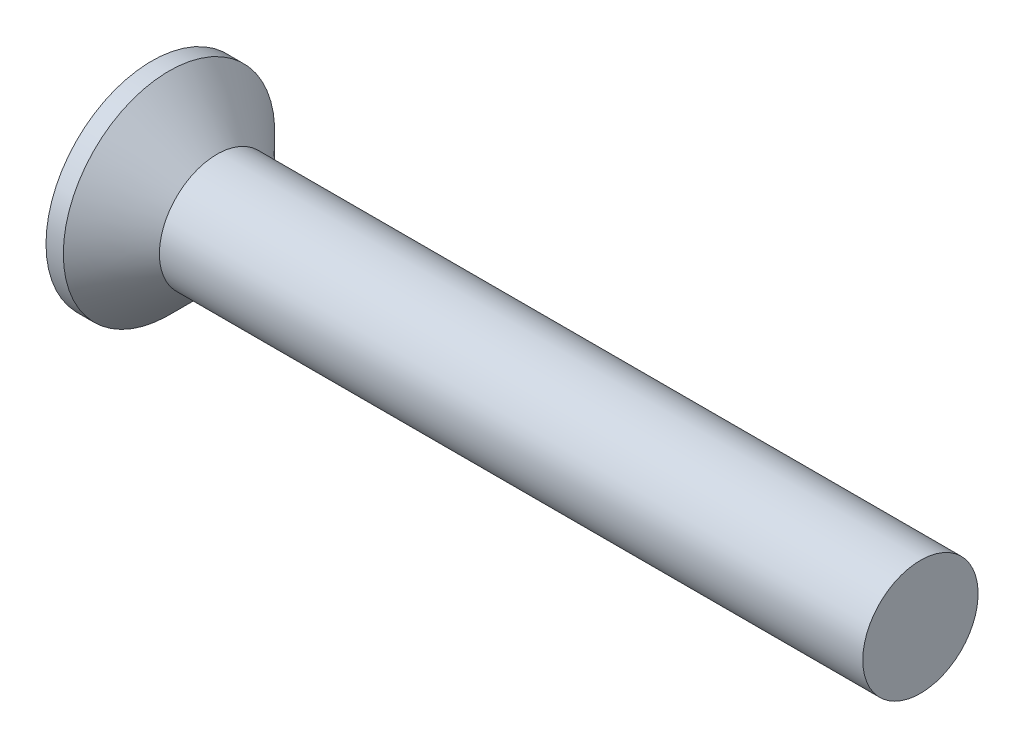
ISO-10303-21;
HEADER;
FILE_DESCRIPTION(('STEP AP214'),'2;1');
FILE_NAME('part.step','',(''),(''),'','','');
FILE_SCHEMA(('AUTOMOTIVE_DESIGN { 1 0 10303 214 1 1 1 1 }'));
ENDSEC;
DATA;
#1=APPLICATION_CONTEXT('core data for automotive mechanical design processes');
#2=APPLICATION_PROTOCOL_DEFINITION('international standard','automotive_design',2000,#1);
#3=PRODUCT_CONTEXT('',#1,'mechanical');
#4=PRODUCT('Part','Part','',(#3));
#5=PRODUCT_RELATED_PRODUCT_CATEGORY('part','',(#4));
#6=PRODUCT_DEFINITION_FORMATION('','',#4);
#7=PRODUCT_DEFINITION_CONTEXT('part definition',#1,'design');
#8=PRODUCT_DEFINITION('design','',#6,#7);
#9=PRODUCT_DEFINITION_SHAPE('','',#8);
#10=(LENGTH_UNIT() NAMED_UNIT(*) SI_UNIT(.MILLI.,.METRE.));
#11=(NAMED_UNIT(*) PLANE_ANGLE_UNIT() SI_UNIT($,.RADIAN.));
#12=(NAMED_UNIT(*) SI_UNIT($,.STERADIAN.) SOLID_ANGLE_UNIT());
#13=UNCERTAINTY_MEASURE_WITH_UNIT(LENGTH_MEASURE(1.E-05),#10,'distance_accuracy_value','');
#14=(GEOMETRIC_REPRESENTATION_CONTEXT(3) GLOBAL_UNCERTAINTY_ASSIGNED_CONTEXT((#13)) GLOBAL_UNIT_ASSIGNED_CONTEXT((#10,
#11,#12)) REPRESENTATION_CONTEXT('',''));
#15=CARTESIAN_POINT('',(0.,0.,0.));
#16=DIRECTION('',(0.,0.,1.));
#17=DIRECTION('',(1.,0.,0.));
#18=AXIS2_PLACEMENT_3D('',#15,#16,#17);
#19=CARTESIAN_POINT('',(0.,0.,0.));
#20=DIRECTION('',(-1.,0.,0.));
#21=DIRECTION('',(0.,0.,1.));
#22=AXIS2_PLACEMENT_3D('',#19,#20,#21);
#23=PLANE('',#22);
#24=CARTESIAN_POINT('',(0.,0.,0.));
#25=DIRECTION('',(-1.,0.,0.));
#26=DIRECTION('',(0.,0.,1.));
#27=AXIS2_PLACEMENT_3D('',#24,#25,#26);
#28=CIRCLE('',#27,2.75);
#29=CARTESIAN_POINT('',(0.,0.,2.75));
#30=VERTEX_POINT('',#29);
#31=EDGE_CURVE('E44',#30,#30,#28,.T.);
#32=ORIENTED_EDGE('',*,*,#31,.T.);
#33=EDGE_LOOP('',(#32));
#34=FACE_BOUND('',#33,.T.);
#35=DIRECTION('',(0.,1.,0.));
#36=VECTOR('',#35,1.);
#37=CARTESIAN_POINT('',(0.,-1.55,-0.395));
#38=LINE('',#37,#36);
#39=CARTESIAN_POINT('',(0.,-1.55,-0.395));
#40=VERTEX_POINT('',#39);
#41=CARTESIAN_POINT('',(0.,-0.394999999999999,-0.395));
#42=VERTEX_POINT('',#41);
#43=EDGE_CURVE('E105',#40,#42,#38,.T.);
#44=ORIENTED_EDGE('',*,*,#43,.T.);
#45=DIRECTION('',(0.,0.,-1.));
#46=VECTOR('',#45,1.);
#47=CARTESIAN_POINT('',(0.,-0.395000000000005,1.55));
#48=LINE('',#47,#46);
#49=CARTESIAN_POINT('',(0.,-0.394999999999995,-1.55));
#50=VERTEX_POINT('',#49);
#51=EDGE_CURVE('E85',#42,#50,#48,.T.);
#52=ORIENTED_EDGE('',*,*,#51,.T.);
#53=DIRECTION('',(0.,1.,0.));
#54=VECTOR('',#53,1.);
#55=CARTESIAN_POINT('',(0.,-0.394999999999995,-1.55));
#56=LINE('',#55,#54);
#57=CARTESIAN_POINT('',(0.,0.395000000000005,-1.55));
#58=VERTEX_POINT('',#57);
#59=EDGE_CURVE('E344',#50,#58,#56,.T.);
#60=ORIENTED_EDGE('',*,*,#59,.T.);
#61=DIRECTION('',(0.,0.,1.));
#62=VECTOR('',#61,1.);
#63=CARTESIAN_POINT('',(0.,0.395000000000005,-1.55));
#64=LINE('',#63,#62);
#65=CARTESIAN_POINT('',(0.,0.395000000000001,-0.395));
#66=VERTEX_POINT('',#65);
#67=EDGE_CURVE('E101',#58,#66,#64,.T.);
#68=ORIENTED_EDGE('',*,*,#67,.T.);
#69=CARTESIAN_POINT('',(0.,1.55,-0.395));
#70=VERTEX_POINT('',#69);
#71=EDGE_CURVE('E95',#66,#70,#38,.T.);
#72=ORIENTED_EDGE('',*,*,#71,.T.);
#73=DIRECTION('',(0.,0.,1.));
#74=VECTOR('',#73,1.);
#75=CARTESIAN_POINT('',(0.,1.55,-0.395));
#76=LINE('',#75,#74);
#77=CARTESIAN_POINT('',(0.,1.55,0.395));
#78=VERTEX_POINT('',#77);
#79=EDGE_CURVE('E98',#70,#78,#76,.T.);
#80=ORIENTED_EDGE('',*,*,#79,.T.);
#81=DIRECTION('',(0.,-1.,0.));
#82=VECTOR('',#81,1.);
#83=CARTESIAN_POINT('',(0.,1.55,0.395));
#84=LINE('',#83,#82);
#85=CARTESIAN_POINT('',(0.,0.394999999999998,0.395));
#86=VERTEX_POINT('',#85);
#87=EDGE_CURVE('E356',#78,#86,#84,.T.);
#88=ORIENTED_EDGE('',*,*,#87,.T.);
#89=CARTESIAN_POINT('',(0.,0.394999999999994,1.55));
#90=VERTEX_POINT('',#89);
#91=EDGE_CURVE('E339',#86,#90,#64,.T.);
#92=ORIENTED_EDGE('',*,*,#91,.T.);
#93=DIRECTION('',(0.,-1.,0.));
#94=VECTOR('',#93,1.);
#95=CARTESIAN_POINT('',(0.,0.394999999999994,1.55));
#96=LINE('',#95,#94);
#97=CARTESIAN_POINT('',(0.,-0.395000000000005,1.55));
#98=VERTEX_POINT('',#97);
#99=EDGE_CURVE('E325',#90,#98,#96,.T.);
#100=ORIENTED_EDGE('',*,*,#99,.T.);
#101=CARTESIAN_POINT('',(0.,-0.395000000000001,0.395));
#102=VERTEX_POINT('',#101);
#103=EDGE_CURVE('E337',#98,#102,#48,.T.);
#104=ORIENTED_EDGE('',*,*,#103,.T.);
#105=CARTESIAN_POINT('',(0.,-1.55,0.395));
#106=VERTEX_POINT('',#105);
#107=EDGE_CURVE('E111',#102,#106,#84,.T.);
#108=ORIENTED_EDGE('',*,*,#107,.T.);
#109=DIRECTION('',(0.,0.,-1.));
#110=VECTOR('',#109,1.);
#111=CARTESIAN_POINT('',(0.,-1.55,0.395));
#112=LINE('',#111,#110);
#113=EDGE_CURVE('E134',#106,#40,#112,.T.);
#114=ORIENTED_EDGE('',*,*,#113,.T.);
#115=EDGE_LOOP('',(#44,#52,#60,#68,#72,#80,#88,#92,#100,#104,#108,#114));
#116=FACE_BOUND('',#115,.T.);
#117=ADVANCED_FACE('F37',(#34,#116),#23,.T.);
#118=CARTESIAN_POINT('',(2.38373382624769,0.,0.16865988909427));
#119=DIRECTION('',(-0.0945267588569115,0.,-0.995522321125954));
#120=DIRECTION('',(-0.995522321125954,0.,0.0945267588569115));
#121=AXIS2_PLACEMENT_3D('',#118,#119,#120);
#122=PLANE('',#121);
#123=ORIENTED_EDGE('',*,*,#107,.F.);
#124=DIRECTION('',(0.991104257398676,0.0941072552097304,-0.0941072552097301));
#125=VECTOR('',#124,1.);
#126=CARTESIAN_POINT('',(2.39946475118715,-0.16716620751949,0.167166207519489));
#127=LINE('',#126,#125);
#128=CARTESIAN_POINT('',(2.08,-0.197500000000001,0.197499999999999));
#129=VERTEX_POINT('',#128);
#130=EDGE_CURVE('E129',#102,#129,#127,.T.);
#131=ORIENTED_EDGE('',*,*,#130,.T.);
#132=DIRECTION('',(0.835707904588477,0.543411029305728,-0.0793520726712617));
#133=VECTOR('',#132,1.);
#134=CARTESIAN_POINT('',(0.,-1.55,0.395));
#135=LINE('',#134,#133);
#136=EDGE_CURVE('E106',#106,#129,#135,.T.);
#137=ORIENTED_EDGE('',*,*,#136,.F.);
#138=EDGE_LOOP('',(#123,#131,#137));
#139=FACE_BOUND('',#138,.T.);
#140=ADVANCED_FACE('F157',(#139),#122,.T.);
#141=DIRECTION('',(0.835707904588477,-0.543411029305729,-0.0793520726712616));
#142=VECTOR('',#141,1.);
#143=CARTESIAN_POINT('',(0.,1.55,0.395));
#144=LINE('',#143,#142);
#145=CARTESIAN_POINT('',(2.08,0.1975,0.1975));
#146=VERTEX_POINT('',#145);
#147=EDGE_CURVE('E51',#78,#146,#144,.T.);
#148=ORIENTED_EDGE('',*,*,#147,.T.);
#149=DIRECTION('',(-0.991104257398676,0.0941072552097297,0.09410725520973));
#150=VECTOR('',#149,1.);
#151=CARTESIAN_POINT('',(2.39946475118715,0.167166207519489,0.167166207519489));
#152=LINE('',#151,#150);
#153=EDGE_CURVE('E352',#146,#86,#152,.T.);
#154=ORIENTED_EDGE('',*,*,#153,.T.);
#155=ORIENTED_EDGE('',*,*,#87,.F.);
#156=EDGE_LOOP('',(#148,#154,#155));
#157=FACE_BOUND('',#156,.T.);
#158=ADVANCED_FACE('F161',(#157),#122,.T.);
#159=CARTESIAN_POINT('',(2.38373382624769,0.,-0.16865988909427));
#160=DIRECTION('',(-0.0945267588569114,0.,0.995522321125954));
#161=DIRECTION('',(0.995522321125954,0.,0.0945267588569114));
#162=AXIS2_PLACEMENT_3D('',#159,#160,#161);
#163=PLANE('',#162);
#164=DIRECTION('',(0.835707904588477,0.543411029305729,0.0793520726712616));
#165=VECTOR('',#164,1.);
#166=CARTESIAN_POINT('',(0.,-1.55,-0.395));
#167=LINE('',#166,#165);
#168=CARTESIAN_POINT('',(2.08,-0.197499999999999,-0.197500000000001));
#169=VERTEX_POINT('',#168);
#170=EDGE_CURVE('E60',#40,#169,#167,.T.);
#171=ORIENTED_EDGE('',*,*,#170,.T.);
#172=DIRECTION('',(-0.991104257398676,-0.0941072552097297,-0.09410725520973));
#173=VECTOR('',#172,1.);
#174=CARTESIAN_POINT('',(2.39946475118715,-0.167166207519489,-0.167166207519489));
#175=LINE('',#174,#173);
#176=EDGE_CURVE('E11',#169,#42,#175,.T.);
#177=ORIENTED_EDGE('',*,*,#176,.T.);
#178=ORIENTED_EDGE('',*,*,#43,.F.);
#179=EDGE_LOOP('',(#171,#177,#178));
#180=FACE_BOUND('',#179,.T.);
#181=ADVANCED_FACE('F154',(#180),#163,.T.);
#182=ORIENTED_EDGE('',*,*,#71,.F.);
#183=DIRECTION('',(0.991104257398676,-0.0941072552097303,0.09410725520973));
#184=VECTOR('',#183,1.);
#185=CARTESIAN_POINT('',(2.39946475118715,0.16716620751949,-0.167166207519489));
#186=LINE('',#185,#184);
#187=CARTESIAN_POINT('',(2.08,0.1975,-0.1975));
#188=VERTEX_POINT('',#187);
#189=EDGE_CURVE('E114',#66,#188,#186,.T.);
#190=ORIENTED_EDGE('',*,*,#189,.T.);
#191=DIRECTION('',(0.835707904588477,-0.543411029305729,0.0793520726712616));
#192=VECTOR('',#191,1.);
#193=CARTESIAN_POINT('',(0.,1.55,-0.395));
#194=LINE('',#193,#192);
#195=EDGE_CURVE('E110',#70,#188,#194,.T.);
#196=ORIENTED_EDGE('',*,*,#195,.F.);
#197=EDGE_LOOP('',(#182,#190,#196));
#198=FACE_BOUND('',#197,.T.);
#199=ADVANCED_FACE('F113',(#198),#163,.T.);
#200=CARTESIAN_POINT('',(-6.34999999999999,0.,0.));
#201=DIRECTION('',(-1.,0.,0.));
#202=DIRECTION('',(0.,0.,1.));
#203=AXIS2_PLACEMENT_3D('',#200,#201,#202);
#204=CYLINDRICAL_SURFACE('',#203,2.75);
#205=CARTESIAN_POINT('',(0.450000000000004,0.,0.));
#206=DIRECTION('',(-1.,0.,0.));
#207=DIRECTION('',(0.,0.,1.));
#208=AXIS2_PLACEMENT_3D('',#205,#206,#207);
#209=CIRCLE('',#208,2.75);
#210=CARTESIAN_POINT('',(0.450000000000004,0.,2.75));
#211=VERTEX_POINT('',#210);
#212=EDGE_CURVE('E137',#211,#211,#209,.T.);
#213=ORIENTED_EDGE('',*,*,#212,.T.);
#214=EDGE_LOOP('',(#213));
#215=FACE_BOUND('',#214,.T.);
#216=ORIENTED_EDGE('',*,*,#31,.F.);
#217=EDGE_LOOP('',(#216));
#218=FACE_BOUND('',#217,.T.);
#219=ADVANCED_FACE('F143',(#215,#218),#204,.T.);
#220=CARTESIAN_POINT('',(0.450000000000004,0.,0.));
#221=DIRECTION('',(-1.,0.,0.));
#222=DIRECTION('',(0.,0.,1.));
#223=AXIS2_PLACEMENT_3D('',#220,#221,#222);
#224=CONICAL_SURFACE('',#223,2.75,0.78539816339745);
#225=CARTESIAN_POINT('',(1.7,0.,0.));
#226=DIRECTION('',(-1.,0.,0.));
#227=DIRECTION('',(0.,0.,1.));
#228=AXIS2_PLACEMENT_3D('',#225,#226,#227);
#229=CIRCLE('',#228,1.5);
#230=CARTESIAN_POINT('',(1.7,0.,1.5));
#231=VERTEX_POINT('',#230);
#232=EDGE_CURVE('E133',#231,#231,#229,.T.);
#233=ORIENTED_EDGE('',*,*,#232,.T.);
#234=EDGE_LOOP('',(#233));
#235=FACE_BOUND('',#234,.T.);
#236=ORIENTED_EDGE('',*,*,#212,.F.);
#237=EDGE_LOOP('',(#236));
#238=FACE_BOUND('',#237,.T.);
#239=ADVANCED_FACE('F145',(#235,#238),#224,.T.);
#240=CARTESIAN_POINT('',(-6.34999999999999,0.,0.));
#241=DIRECTION('',(-1.,0.,0.));
#242=DIRECTION('',(0.,0.,1.));
#243=AXIS2_PLACEMENT_3D('',#240,#241,#242);
#244=CYLINDRICAL_SURFACE('',#243,1.5);
#245=CARTESIAN_POINT('',(20.,0.,0.));
#246=DIRECTION('',(-1.,0.,0.));
#247=DIRECTION('',(0.,0.,1.));
#248=AXIS2_PLACEMENT_3D('',#245,#246,#247);
#249=CIRCLE('',#248,1.5);
#250=CARTESIAN_POINT('',(20.,0.,1.5));
#251=VERTEX_POINT('',#250);
#252=EDGE_CURVE('E130',#251,#251,#249,.T.);
#253=ORIENTED_EDGE('',*,*,#252,.T.);
#254=EDGE_LOOP('',(#253));
#255=FACE_BOUND('',#254,.T.);
#256=ORIENTED_EDGE('',*,*,#232,.F.);
#257=EDGE_LOOP('',(#256));
#258=FACE_BOUND('',#257,.T.);
#259=ADVANCED_FACE('F151',(#255,#258),#244,.T.);
#260=CARTESIAN_POINT('',(20.,1.5,0.));
#261=DIRECTION('',(1.,0.,0.));
#262=DIRECTION('',(0.,0.,-1.));
#263=AXIS2_PLACEMENT_3D('',#260,#261,#262);
#264=PLANE('',#263);
#265=ORIENTED_EDGE('',*,*,#252,.F.);
#266=EDGE_LOOP('',(#265));
#267=FACE_BOUND('',#266,.T.);
#268=ADVANCED_FACE('F181',(#267),#264,.T.);
#269=CARTESIAN_POINT('',(2.08,0.1975,-0.1975));
#270=DIRECTION('',(1.,0.,0.));
#271=DIRECTION('',(0.,0.,-1.));
#272=AXIS2_PLACEMENT_3D('',#269,#270,#271);
#273=PLANE('',#272);
#274=DIRECTION('',(0.,1.,0.));
#275=VECTOR('',#274,1.);
#276=CARTESIAN_POINT('',(2.08,-0.1975,-0.1975));
#277=LINE('',#276,#275);
#278=EDGE_CURVE('E125',#169,#188,#277,.T.);
#279=ORIENTED_EDGE('',*,*,#278,.F.);
#280=DIRECTION('',(0.,0.,-1.));
#281=VECTOR('',#280,1.);
#282=CARTESIAN_POINT('',(2.08,-0.1975,0.1975));
#283=LINE('',#282,#281);
#284=EDGE_CURVE('E116',#129,#169,#283,.T.);
#285=ORIENTED_EDGE('',*,*,#284,.F.);
#286=DIRECTION('',(0.,-1.,0.));
#287=VECTOR('',#286,1.);
#288=CARTESIAN_POINT('',(2.08,0.1975,0.1975));
#289=LINE('',#288,#287);
#290=EDGE_CURVE('E119',#146,#129,#289,.T.);
#291=ORIENTED_EDGE('',*,*,#290,.F.);
#292=DIRECTION('',(0.,0.,1.));
#293=VECTOR('',#292,1.);
#294=CARTESIAN_POINT('',(2.08,0.1975,-0.1975));
#295=LINE('',#294,#293);
#296=EDGE_CURVE('E123',#188,#146,#295,.T.);
#297=ORIENTED_EDGE('',*,*,#296,.F.);
#298=EDGE_LOOP('',(#279,#285,#291,#297));
#299=FACE_BOUND('',#298,.T.);
#300=ADVANCED_FACE('F178',(#299),#273,.F.);
#301=CARTESIAN_POINT('',(0.,-1.55,-0.395));
#302=DIRECTION('',(-0.54513001368185,0.838351518268576,0.));
#303=DIRECTION('',(-0.838351518268576,-0.54513001368185,0.));
#304=AXIS2_PLACEMENT_3D('',#301,#302,#303);
#305=PLANE('',#304);
#306=ORIENTED_EDGE('',*,*,#170,.F.);
#307=ORIENTED_EDGE('',*,*,#113,.F.);
#308=ORIENTED_EDGE('',*,*,#136,.T.);
#309=ORIENTED_EDGE('',*,*,#284,.T.);
#310=EDGE_LOOP('',(#306,#307,#308,#309));
#311=FACE_BOUND('',#310,.T.);
#312=ADVANCED_FACE('F170',(#311),#305,.T.);
#313=CARTESIAN_POINT('',(0.,1.55,0.395));
#314=DIRECTION('',(-0.54513001368185,-0.838351518268576,0.));
#315=DIRECTION('',(0.838351518268576,-0.54513001368185,0.));
#316=AXIS2_PLACEMENT_3D('',#313,#314,#315);
#317=PLANE('',#316);
#318=ORIENTED_EDGE('',*,*,#147,.F.);
#319=ORIENTED_EDGE('',*,*,#79,.F.);
#320=ORIENTED_EDGE('',*,*,#195,.T.);
#321=ORIENTED_EDGE('',*,*,#296,.T.);
#322=EDGE_LOOP('',(#318,#319,#320,#321));
#323=FACE_BOUND('',#322,.T.);
#324=ADVANCED_FACE('F109',(#323),#317,.T.);
#325=CARTESIAN_POINT('',(2.38373382624769,-0.16865988909427,0.));
#326=DIRECTION('',(-0.0945267588569115,0.995522321125954,0.));
#327=DIRECTION('',(-0.995522321125954,-0.0945267588569115,0.));
#328=AXIS2_PLACEMENT_3D('',#325,#326,#327);
#329=PLANE('',#328);
#330=DIRECTION('',(0.835707904588477,0.0793520726712598,0.543411029305729));
#331=VECTOR('',#330,1.);
#332=CARTESIAN_POINT('',(0.,-0.394999999999995,-1.55));
#333=LINE('',#332,#331);
#334=EDGE_CURVE('E346',#50,#169,#333,.T.);
#335=ORIENTED_EDGE('',*,*,#334,.F.);
#336=ORIENTED_EDGE('',*,*,#51,.F.);
#337=ORIENTED_EDGE('',*,*,#176,.F.);
#338=EDGE_LOOP('',(#335,#336,#337));
#339=FACE_BOUND('',#338,.T.);
#340=ADVANCED_FACE('F177',(#339),#329,.T.);
#341=CARTESIAN_POINT('',(2.38373382624769,0.16865988909427,0.));
#342=DIRECTION('',(-0.0945267588569114,-0.995522321125954,0.));
#343=DIRECTION('',(0.995522321125954,-0.0945267588569114,0.));
#344=AXIS2_PLACEMENT_3D('',#341,#342,#343);
#345=PLANE('',#344);
#346=ORIENTED_EDGE('',*,*,#67,.F.);
#347=DIRECTION('',(0.835707904588477,-0.0793520726712635,0.543411029305728));
#348=VECTOR('',#347,1.);
#349=CARTESIAN_POINT('',(0.,0.395000000000005,-1.55));
#350=LINE('',#349,#348);
#351=EDGE_CURVE('E76',#58,#188,#350,.T.);
#352=ORIENTED_EDGE('',*,*,#351,.T.);
#353=ORIENTED_EDGE('',*,*,#189,.F.);
#354=EDGE_LOOP('',(#346,#352,#353));
#355=FACE_BOUND('',#354,.T.);
#356=ADVANCED_FACE('F222',(#355),#345,.T.);
#357=CARTESIAN_POINT('',(0.,0.395000000000005,-1.55));
#358=DIRECTION('',(-0.54513001368185,0.,0.838351518268576));
#359=DIRECTION('',(-0.838351518268576,0.,-0.54513001368185));
#360=AXIS2_PLACEMENT_3D('',#357,#358,#359);
#361=PLANE('',#360);
#362=ORIENTED_EDGE('',*,*,#351,.F.);
#363=ORIENTED_EDGE('',*,*,#59,.F.);
#364=ORIENTED_EDGE('',*,*,#334,.T.);
#365=ORIENTED_EDGE('',*,*,#278,.T.);
#366=EDGE_LOOP('',(#362,#363,#364,#365));
#367=FACE_BOUND('',#366,.T.);
#368=ADVANCED_FACE('F230',(#367),#361,.T.);
#369=ORIENTED_EDGE('',*,*,#103,.F.);
#370=DIRECTION('',(0.835707904588477,0.0793520726712635,-0.543411029305728));
#371=VECTOR('',#370,1.);
#372=CARTESIAN_POINT('',(0.,-0.395000000000005,1.55));
#373=LINE('',#372,#371);
#374=EDGE_CURVE('E322',#98,#129,#373,.T.);
#375=ORIENTED_EDGE('',*,*,#374,.T.);
#376=ORIENTED_EDGE('',*,*,#130,.F.);
#377=EDGE_LOOP('',(#369,#375,#376));
#378=FACE_BOUND('',#377,.T.);
#379=ADVANCED_FACE('F224',(#378),#329,.T.);
#380=DIRECTION('',(0.835707904588477,-0.0793520726712597,-0.543411029305729));
#381=VECTOR('',#380,1.);
#382=CARTESIAN_POINT('',(0.,0.394999999999994,1.55));
#383=LINE('',#382,#381);
#384=EDGE_CURVE('E333',#90,#146,#383,.T.);
#385=ORIENTED_EDGE('',*,*,#384,.F.);
#386=ORIENTED_EDGE('',*,*,#91,.F.);
#387=ORIENTED_EDGE('',*,*,#153,.F.);
#388=EDGE_LOOP('',(#385,#386,#387));
#389=FACE_BOUND('',#388,.T.);
#390=ADVANCED_FACE('F232',(#389),#345,.T.);
#391=CARTESIAN_POINT('',(0.,-0.395000000000005,1.55));
#392=DIRECTION('',(-0.54513001368185,0.,-0.838351518268576));
#393=DIRECTION('',(0.838351518268576,0.,-0.54513001368185));
#394=AXIS2_PLACEMENT_3D('',#391,#392,#393);
#395=PLANE('',#394);
#396=ORIENTED_EDGE('',*,*,#374,.F.);
#397=ORIENTED_EDGE('',*,*,#99,.F.);
#398=ORIENTED_EDGE('',*,*,#384,.T.);
#399=ORIENTED_EDGE('',*,*,#290,.T.);
#400=EDGE_LOOP('',(#396,#397,#398,#399));
#401=FACE_BOUND('',#400,.T.);
#402=ADVANCED_FACE('F251',(#401),#395,.T.);
#403=CLOSED_SHELL('',(#117,#140,#158,#181,#199,#219,#239,#259,#268,#300,#312,#324,#340,#356,
#368,#379,#390,#402));
#404=MANIFOLD_SOLID_BREP('B2',#403);
#405=ADVANCED_BREP_SHAPE_REPRESENTATION('',(#18,#404),#14);
#406=SHAPE_DEFINITION_REPRESENTATION(#9,#405);
ENDSEC;
END-ISO-10303-21;
